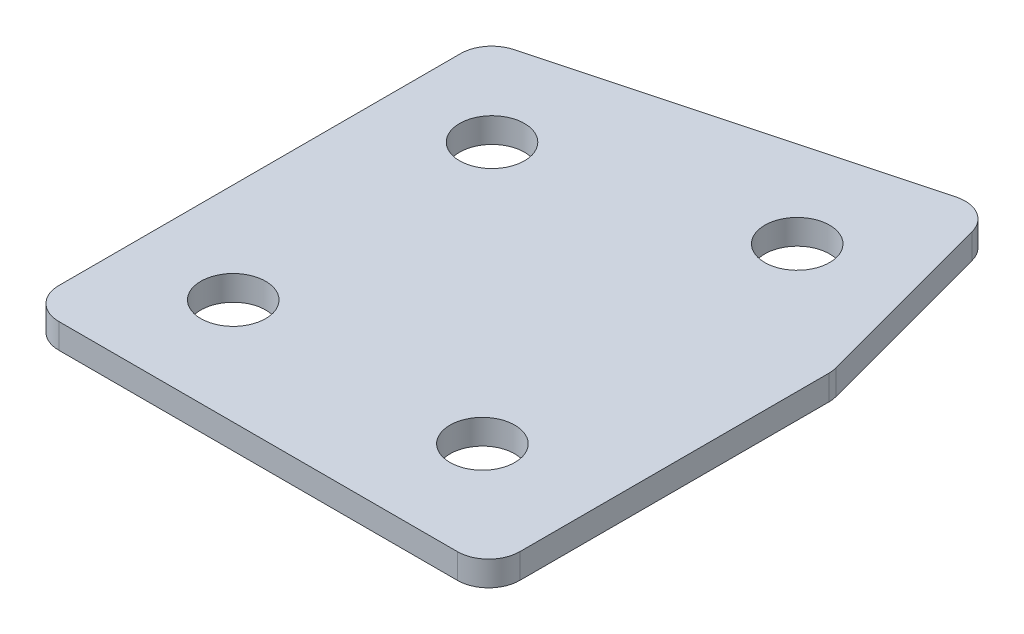
ISO-10303-21;
HEADER;
FILE_DESCRIPTION(('STEP AP214'),'2;1');
FILE_NAME('part.step','',(''),(''),'','','');
FILE_SCHEMA(('AUTOMOTIVE_DESIGN { 1 0 10303 214 1 1 1 1 }'));
ENDSEC;
DATA;
#1=APPLICATION_CONTEXT('core data for automotive mechanical design processes');
#2=APPLICATION_PROTOCOL_DEFINITION('international standard','automotive_design',2000,#1);
#3=PRODUCT_CONTEXT('',#1,'mechanical');
#4=PRODUCT('Part','Part','',(#3));
#5=PRODUCT_RELATED_PRODUCT_CATEGORY('part','',(#4));
#6=PRODUCT_DEFINITION_FORMATION('','',#4);
#7=PRODUCT_DEFINITION_CONTEXT('part definition',#1,'design');
#8=PRODUCT_DEFINITION('design','',#6,#7);
#9=PRODUCT_DEFINITION_SHAPE('','',#8);
#10=(LENGTH_UNIT() NAMED_UNIT(*) SI_UNIT(.MILLI.,.METRE.));
#11=(NAMED_UNIT(*) PLANE_ANGLE_UNIT() SI_UNIT($,.RADIAN.));
#12=(NAMED_UNIT(*) SI_UNIT($,.STERADIAN.) SOLID_ANGLE_UNIT());
#13=UNCERTAINTY_MEASURE_WITH_UNIT(LENGTH_MEASURE(1.E-05),#10,'distance_accuracy_value','');
#14=(GEOMETRIC_REPRESENTATION_CONTEXT(3) GLOBAL_UNCERTAINTY_ASSIGNED_CONTEXT((#13)) GLOBAL_UNIT_ASSIGNED_CONTEXT((#10,
#11,#12)) REPRESENTATION_CONTEXT('',''));
#15=CARTESIAN_POINT('',(0.,0.,0.));
#16=DIRECTION('',(0.,0.,1.));
#17=DIRECTION('',(1.,0.,0.));
#18=AXIS2_PLACEMENT_3D('',#15,#16,#17);
#19=CARTESIAN_POINT('',(-92.4222776450681,1.70798729371791,12.808819041555));
#20=DIRECTION('',(0.,1.,0.));
#21=DIRECTION('',(0.,0.,1.));
#22=AXIS2_PLACEMENT_3D('',#19,#20,#21);
#23=PLANE('',#22);
#24=CARTESIAN_POINT('',(7.85888258013483,1.70798729371791,12.808819041555));
#25=DIRECTION('',(0.,1.,0.));
#26=DIRECTION('',(0.,0.,1.));
#27=AXIS2_PLACEMENT_3D('',#24,#25,#26);
#28=CIRCLE('',#27,2.6);
#29=CARTESIAN_POINT('',(7.85888258013483,1.70798729371791,15.408819041555));
#30=VERTEX_POINT('',#29);
#31=EDGE_CURVE('E201',#30,#30,#28,.T.);
#32=ORIENTED_EDGE('',*,*,#31,.T.);
#33=EDGE_LOOP('',(#32));
#34=FACE_BOUND('',#33,.T.);
#35=CARTESIAN_POINT('',(6.59439677936349,1.70798729371791,-13.7226189076865));
#36=DIRECTION('',(0.,1.,0.));
#37=DIRECTION('',(0.,0.,1.));
#38=AXIS2_PLACEMENT_3D('',#35,#36,#37);
#39=CIRCLE('',#38,2.6);
#40=CARTESIAN_POINT('',(6.59439677936349,1.70798729371791,-11.1226189076865));
#41=VERTEX_POINT('',#40);
#42=EDGE_CURVE('E195',#41,#41,#39,.T.);
#43=ORIENTED_EDGE('',*,*,#42,.T.);
#44=EDGE_LOOP('',(#43));
#45=FACE_BOUND('',#44,.T.);
#46=CARTESIAN_POINT('',(-12.7241197464179,1.70798729371791,-8.5462380056361));
#47=DIRECTION('',(0.,1.,0.));
#48=DIRECTION('',(0.,0.,1.));
#49=AXIS2_PLACEMENT_3D('',#46,#47,#48);
#50=CIRCLE('',#49,2.6);
#51=CARTESIAN_POINT('',(-12.7241197464179,1.70798729371791,-5.94623800563609));
#52=VERTEX_POINT('',#51);
#53=EDGE_CURVE('E189',#52,#52,#50,.T.);
#54=ORIENTED_EDGE('',*,*,#53,.T.);
#55=EDGE_LOOP('',(#54));
#56=FACE_BOUND('',#55,.T.);
#57=CARTESIAN_POINT('',(-12.1411174198652,1.70798729371791,12.808819041555));
#58=DIRECTION('',(0.,1.,0.));
#59=DIRECTION('',(0.,0.,1.));
#60=AXIS2_PLACEMENT_3D('',#57,#58,#59);
#61=CIRCLE('',#60,2.6);
#62=CARTESIAN_POINT('',(-12.1411174198652,1.70798729371791,15.408819041555));
#63=VERTEX_POINT('',#62);
#64=EDGE_CURVE('E115',#63,#63,#61,.T.);
#65=ORIENTED_EDGE('',*,*,#64,.T.);
#66=EDGE_LOOP('',(#65));
#67=FACE_BOUND('',#66,.T.);
#68=DIRECTION('',(0.,0.,1.));
#69=VECTOR('',#68,1.);
#70=CARTESIAN_POINT('',(-20.1411174198652,1.70798729371791,-15.3587070022581));
#71=LINE('',#70,#69);
#72=CARTESIAN_POINT('',(-20.1411174198652,1.70798729371791,-13.4403895323107));
#73=VERTEX_POINT('',#72);
#74=CARTESIAN_POINT('',(-20.1411174198652,1.70798729371791,18.8088190415552));
#75=VERTEX_POINT('',#74);
#76=EDGE_CURVE('E182',#73,#75,#71,.T.);
#77=ORIENTED_EDGE('',*,*,#76,.F.);
#78=CARTESIAN_POINT('',(-17.6411174198652,1.70798729371791,-13.4403895323107));
#79=DIRECTION('',(0.,1.,0.));
#80=DIRECTION('',(0.,0.,1.));
#81=AXIS2_PLACEMENT_3D('',#78,#79,#80);
#82=CIRCLE('',#81,2.5);
#83=CARTESIAN_POINT('',(-18.2881650326215,1.70798729371791,-15.8552040980334));
#84=VERTEX_POINT('',#83);
#85=EDGE_CURVE('E146',#73,#84,#82,.F.);
#86=ORIENTED_EDGE('',*,*,#85,.T.);
#87=DIRECTION('',(-0.965925826289068,0.,0.258819045102521));
#88=VECTOR('',#87,1.);
#89=CARTESIAN_POINT('',(12.1218415063046,1.70798729371791,-24.0035407919638));
#90=LINE('',#89,#88);
#91=CARTESIAN_POINT('',(9.70702694058193,1.70798729371791,-23.3564931792075));
#92=VERTEX_POINT('',#91);
#93=EDGE_CURVE('E174',#92,#84,#90,.T.);
#94=ORIENTED_EDGE('',*,*,#93,.F.);
#95=CARTESIAN_POINT('',(10.3540745533382,1.70798729371791,-20.9416786134848));
#96=DIRECTION('',(0.,1.,0.));
#97=DIRECTION('',(0.,0.,1.));
#98=AXIS2_PLACEMENT_3D('',#95,#96,#97);
#99=CIRCLE('',#98,2.5);
#100=CARTESIAN_POINT('',(12.7688891190609,1.70798729371791,-21.5887262262411));
#101=VERTEX_POINT('',#100);
#102=EDGE_CURVE('E118',#92,#101,#99,.F.);
#103=ORIENTED_EDGE('',*,*,#102,.T.);
#104=DIRECTION('',(-0.25881904510252,0.,-0.965925826289069));
#105=VECTOR('',#104,1.);
#106=CARTESIAN_POINT('',(16.8588825801348,1.70798729371791,-6.32466282688861));
#107=LINE('',#106,#105);
#108=CARTESIAN_POINT('',(16.7736971458575,1.70798729371791,-6.64257919567641));
#109=VERTEX_POINT('',#108);
#110=EDGE_CURVE('E119',#109,#101,#107,.T.);
#111=ORIENTED_EDGE('',*,*,#110,.F.);
#112=CARTESIAN_POINT('',(14.3588825801348,1.70798729371791,-5.99553158292011));
#113=DIRECTION('',(0.,1.,0.));
#114=DIRECTION('',(0.,0.,1.));
#115=AXIS2_PLACEMENT_3D('',#112,#113,#114);
#116=CIRCLE('',#115,2.5);
#117=CARTESIAN_POINT('',(16.8588825801348,1.70798729371791,-5.99553158292011));
#118=VERTEX_POINT('',#117);
#119=EDGE_CURVE('E141',#109,#118,#116,.F.);
#120=ORIENTED_EDGE('',*,*,#119,.T.);
#121=DIRECTION('',(0.,0.,-1.));
#122=VECTOR('',#121,1.);
#123=CARTESIAN_POINT('',(16.8588825801348,1.70798729371791,21.3088190415552));
#124=LINE('',#123,#122);
#125=CARTESIAN_POINT('',(16.8588825801348,1.70798729371791,18.8088190415552));
#126=VERTEX_POINT('',#125);
#127=EDGE_CURVE('E123',#126,#118,#124,.T.);
#128=ORIENTED_EDGE('',*,*,#127,.F.);
#129=CARTESIAN_POINT('',(14.3588825801348,1.70798729371791,18.8088190415552));
#130=DIRECTION('',(0.,1.,0.));
#131=DIRECTION('',(0.,0.,1.));
#132=AXIS2_PLACEMENT_3D('',#129,#130,#131);
#133=CIRCLE('',#132,2.5);
#134=CARTESIAN_POINT('',(14.3588825801348,1.70798729371791,21.3088190415552));
#135=VERTEX_POINT('',#134);
#136=EDGE_CURVE('E31',#126,#135,#133,.F.);
#137=ORIENTED_EDGE('',*,*,#136,.T.);
#138=DIRECTION('',(1.,0.,0.));
#139=VECTOR('',#138,1.);
#140=CARTESIAN_POINT('',(-20.1411174198652,1.70798729371791,21.3088190415552));
#141=LINE('',#140,#139);
#142=CARTESIAN_POINT('',(-17.6411174198652,1.70798729371791,21.3088190415552));
#143=VERTEX_POINT('',#142);
#144=EDGE_CURVE('E180',#143,#135,#141,.T.);
#145=ORIENTED_EDGE('',*,*,#144,.F.);
#146=CARTESIAN_POINT('',(-17.6411174198652,1.70798729371791,18.8088190415552));
#147=DIRECTION('',(0.,1.,0.));
#148=DIRECTION('',(0.,0.,1.));
#149=AXIS2_PLACEMENT_3D('',#146,#147,#148);
#150=CIRCLE('',#149,2.5);
#151=EDGE_CURVE('E144',#143,#75,#150,.F.);
#152=ORIENTED_EDGE('',*,*,#151,.T.);
#153=EDGE_LOOP('',(#77,#86,#94,#103,#111,#120,#128,#137,#145,#152));
#154=FACE_BOUND('',#153,.T.);
#155=ADVANCED_FACE('F16',(#34,#45,#56,#67,#154),#23,.F.);
#156=CARTESIAN_POINT('',(12.1218415063046,1.70798729371791,-24.0035407919638));
#157=DIRECTION('',(-0.258819045102521,0.,-0.965925826289068));
#158=DIRECTION('',(-0.965925826289068,0.,0.258819045102521));
#159=AXIS2_PLACEMENT_3D('',#156,#157,#158);
#160=PLANE('',#159);
#161=ORIENTED_EDGE('',*,*,#93,.T.);
#162=DIRECTION('',(0.,1.,0.));
#163=VECTOR('',#162,1.);
#164=CARTESIAN_POINT('',(-18.2881650326215,1.70798729371791,-15.8552040980334));
#165=LINE('',#164,#163);
#166=CARTESIAN_POINT('',(-18.2881650326215,3.70798729371791,-15.8552040980334));
#167=VERTEX_POINT('',#166);
#168=EDGE_CURVE('E105',#84,#167,#165,.T.);
#169=ORIENTED_EDGE('',*,*,#168,.T.);
#170=DIRECTION('',(-0.965925826289068,0.,0.258819045102521));
#171=VECTOR('',#170,1.);
#172=CARTESIAN_POINT('',(12.1218415063046,3.70798729371791,-24.0035407919638));
#173=LINE('',#172,#171);
#174=CARTESIAN_POINT('',(9.70702694058193,3.70798729371791,-23.3564931792075));
#175=VERTEX_POINT('',#174);
#176=EDGE_CURVE('E97',#175,#167,#173,.T.);
#177=ORIENTED_EDGE('',*,*,#176,.F.);
#178=DIRECTION('',(0.,1.,0.));
#179=VECTOR('',#178,1.);
#180=CARTESIAN_POINT('',(9.70702694058193,1.70798729371791,-23.3564931792075));
#181=LINE('',#180,#179);
#182=EDGE_CURVE('E111',#175,#92,#181,.F.);
#183=ORIENTED_EDGE('',*,*,#182,.T.);
#184=EDGE_LOOP('',(#161,#169,#177,#183));
#185=FACE_BOUND('',#184,.T.);
#186=ADVANCED_FACE('F110',(#185),#160,.T.);
#187=CARTESIAN_POINT('',(16.8588825801348,1.70798729371791,-6.32466282688861));
#188=DIRECTION('',(0.965925826289069,0.,-0.25881904510252));
#189=DIRECTION('',(-0.25881904510252,0.,-0.965925826289069));
#190=AXIS2_PLACEMENT_3D('',#187,#188,#189);
#191=PLANE('',#190);
#192=DIRECTION('',(-0.25881904510252,0.,-0.965925826289069));
#193=VECTOR('',#192,1.);
#194=CARTESIAN_POINT('',(16.8588825801348,3.70798729371791,-6.32466282688861));
#195=LINE('',#194,#193);
#196=CARTESIAN_POINT('',(16.7736971458575,3.70798729371791,-6.64257919567641));
#197=VERTEX_POINT('',#196);
#198=CARTESIAN_POINT('',(12.7688891190609,3.70798729371791,-21.5887262262411));
#199=VERTEX_POINT('',#198);
#200=EDGE_CURVE('E99',#197,#199,#195,.T.);
#201=ORIENTED_EDGE('',*,*,#200,.F.);
#202=DIRECTION('',(0.,1.,0.));
#203=VECTOR('',#202,1.);
#204=CARTESIAN_POINT('',(16.7736971458575,1.70798729371791,-6.64257919567641));
#205=LINE('',#204,#203);
#206=EDGE_CURVE('E10',#197,#109,#205,.F.);
#207=ORIENTED_EDGE('',*,*,#206,.T.);
#208=ORIENTED_EDGE('',*,*,#110,.T.);
#209=DIRECTION('',(0.,1.,0.));
#210=VECTOR('',#209,1.);
#211=CARTESIAN_POINT('',(12.7688891190609,1.70798729371791,-21.5887262262411));
#212=LINE('',#211,#210);
#213=EDGE_CURVE('E24',#101,#199,#212,.T.);
#214=ORIENTED_EDGE('',*,*,#213,.T.);
#215=EDGE_LOOP('',(#201,#207,#208,#214));
#216=FACE_BOUND('',#215,.T.);
#217=ADVANCED_FACE('F157',(#216),#191,.T.);
#218=CARTESIAN_POINT('',(16.8588825801348,1.70798729371791,21.3088190415552));
#219=DIRECTION('',(1.,0.,0.));
#220=DIRECTION('',(0.,0.,-1.));
#221=AXIS2_PLACEMENT_3D('',#218,#219,#220);
#222=PLANE('',#221);
#223=DIRECTION('',(0.,0.,-1.));
#224=VECTOR('',#223,1.);
#225=CARTESIAN_POINT('',(16.8588825801348,3.70798729371791,21.3088190415552));
#226=LINE('',#225,#224);
#227=CARTESIAN_POINT('',(16.8588825801348,3.70798729371791,18.8088190415552));
#228=VERTEX_POINT('',#227);
#229=CARTESIAN_POINT('',(16.8588825801348,3.70798729371791,-5.99553158292011));
#230=VERTEX_POINT('',#229);
#231=EDGE_CURVE('E170',#228,#230,#226,.T.);
#232=ORIENTED_EDGE('',*,*,#231,.F.);
#233=DIRECTION('',(0.,1.,0.));
#234=VECTOR('',#233,1.);
#235=CARTESIAN_POINT('',(16.8588825801348,1.70798729371791,18.8088190415552));
#236=LINE('',#235,#234);
#237=EDGE_CURVE('E155',#228,#126,#236,.F.);
#238=ORIENTED_EDGE('',*,*,#237,.T.);
#239=ORIENTED_EDGE('',*,*,#127,.T.);
#240=DIRECTION('',(0.,1.,0.));
#241=VECTOR('',#240,1.);
#242=CARTESIAN_POINT('',(16.8588825801348,1.70798729371791,-5.99553158292011));
#243=LINE('',#242,#241);
#244=EDGE_CURVE('E152',#118,#230,#243,.T.);
#245=ORIENTED_EDGE('',*,*,#244,.T.);
#246=EDGE_LOOP('',(#232,#238,#239,#245));
#247=FACE_BOUND('',#246,.T.);
#248=ADVANCED_FACE('F169',(#247),#222,.T.);
#249=CARTESIAN_POINT('',(-20.1411174198652,1.70798729371791,21.3088190415552));
#250=DIRECTION('',(0.,0.,1.));
#251=DIRECTION('',(1.,0.,0.));
#252=AXIS2_PLACEMENT_3D('',#249,#250,#251);
#253=PLANE('',#252);
#254=DIRECTION('',(1.,0.,0.));
#255=VECTOR('',#254,1.);
#256=CARTESIAN_POINT('',(-20.1411174198652,3.70798729371791,21.3088190415552));
#257=LINE('',#256,#255);
#258=CARTESIAN_POINT('',(-17.6411174198652,3.70798729371791,21.3088190415552));
#259=VERTEX_POINT('',#258);
#260=CARTESIAN_POINT('',(14.3588825801348,3.70798729371791,21.3088190415552));
#261=VERTEX_POINT('',#260);
#262=EDGE_CURVE('E173',#259,#261,#257,.T.);
#263=ORIENTED_EDGE('',*,*,#262,.F.);
#264=DIRECTION('',(0.,1.,0.));
#265=VECTOR('',#264,1.);
#266=CARTESIAN_POINT('',(-17.6411174198652,1.70798729371791,21.3088190415552));
#267=LINE('',#266,#265);
#268=EDGE_CURVE('E38',#259,#143,#267,.F.);
#269=ORIENTED_EDGE('',*,*,#268,.T.);
#270=ORIENTED_EDGE('',*,*,#144,.T.);
#271=DIRECTION('',(0.,1.,0.));
#272=VECTOR('',#271,1.);
#273=CARTESIAN_POINT('',(14.3588825801348,1.70798729371791,21.3088190415552));
#274=LINE('',#273,#272);
#275=EDGE_CURVE('E148',#135,#261,#274,.T.);
#276=ORIENTED_EDGE('',*,*,#275,.T.);
#277=EDGE_LOOP('',(#263,#269,#270,#276));
#278=FACE_BOUND('',#277,.T.);
#279=ADVANCED_FACE('F333',(#278),#253,.T.);
#280=CARTESIAN_POINT('',(-20.1411174198652,1.70798729371791,-15.3587070022581));
#281=DIRECTION('',(-1.,0.,0.));
#282=DIRECTION('',(0.,0.,1.));
#283=AXIS2_PLACEMENT_3D('',#280,#281,#282);
#284=PLANE('',#283);
#285=DIRECTION('',(0.,0.,1.));
#286=VECTOR('',#285,1.);
#287=CARTESIAN_POINT('',(-20.1411174198652,3.70798729371791,-15.3587070022581));
#288=LINE('',#287,#286);
#289=CARTESIAN_POINT('',(-20.1411174198652,3.70798729371791,-13.4403895323107));
#290=VERTEX_POINT('',#289);
#291=CARTESIAN_POINT('',(-20.1411174198652,3.70798729371791,18.8088190415552));
#292=VERTEX_POINT('',#291);
#293=EDGE_CURVE('E114',#290,#292,#288,.T.);
#294=ORIENTED_EDGE('',*,*,#293,.F.);
#295=DIRECTION('',(0.,1.,0.));
#296=VECTOR('',#295,1.);
#297=CARTESIAN_POINT('',(-20.1411174198652,1.70798729371791,-13.4403895323107));
#298=LINE('',#297,#296);
#299=EDGE_CURVE('E138',#290,#73,#298,.F.);
#300=ORIENTED_EDGE('',*,*,#299,.T.);
#301=ORIENTED_EDGE('',*,*,#76,.T.);
#302=DIRECTION('',(0.,1.,0.));
#303=VECTOR('',#302,1.);
#304=CARTESIAN_POINT('',(-20.1411174198652,1.70798729371791,18.8088190415552));
#305=LINE('',#304,#303);
#306=EDGE_CURVE('E135',#75,#292,#305,.T.);
#307=ORIENTED_EDGE('',*,*,#306,.T.);
#308=EDGE_LOOP('',(#294,#300,#301,#307));
#309=FACE_BOUND('',#308,.T.);
#310=ADVANCED_FACE('F223',(#309),#284,.T.);
#311=CARTESIAN_POINT('',(-92.4222776450681,3.70798729371791,12.808819041555));
#312=DIRECTION('',(0.,1.,0.));
#313=DIRECTION('',(0.,0.,1.));
#314=AXIS2_PLACEMENT_3D('',#311,#312,#313);
#315=PLANE('',#314);
#316=CARTESIAN_POINT('',(7.85888258013483,3.70798729371791,12.808819041555));
#317=DIRECTION('',(0.,1.,0.));
#318=DIRECTION('',(0.,0.,1.));
#319=AXIS2_PLACEMENT_3D('',#316,#317,#318);
#320=CIRCLE('',#319,2.6);
#321=CARTESIAN_POINT('',(7.85888258013483,3.70798729371791,15.408819041555));
#322=VERTEX_POINT('',#321);
#323=EDGE_CURVE('E204',#322,#322,#320,.T.);
#324=ORIENTED_EDGE('',*,*,#323,.F.);
#325=EDGE_LOOP('',(#324));
#326=FACE_BOUND('',#325,.T.);
#327=CARTESIAN_POINT('',(6.59439677936349,3.70798729371791,-13.7226189076865));
#328=DIRECTION('',(0.,1.,0.));
#329=DIRECTION('',(0.,0.,1.));
#330=AXIS2_PLACEMENT_3D('',#327,#328,#329);
#331=CIRCLE('',#330,2.6);
#332=CARTESIAN_POINT('',(6.59439677936349,3.70798729371791,-11.1226189076865));
#333=VERTEX_POINT('',#332);
#334=EDGE_CURVE('E198',#333,#333,#331,.T.);
#335=ORIENTED_EDGE('',*,*,#334,.F.);
#336=EDGE_LOOP('',(#335));
#337=FACE_BOUND('',#336,.T.);
#338=CARTESIAN_POINT('',(-12.7241197464179,3.70798729371791,-8.5462380056361));
#339=DIRECTION('',(0.,1.,0.));
#340=DIRECTION('',(0.,0.,1.));
#341=AXIS2_PLACEMENT_3D('',#338,#339,#340);
#342=CIRCLE('',#341,2.6);
#343=CARTESIAN_POINT('',(-12.7241197464179,3.70798729371791,-5.94623800563609));
#344=VERTEX_POINT('',#343);
#345=EDGE_CURVE('E192',#344,#344,#342,.T.);
#346=ORIENTED_EDGE('',*,*,#345,.F.);
#347=EDGE_LOOP('',(#346));
#348=FACE_BOUND('',#347,.T.);
#349=CARTESIAN_POINT('',(-12.1411174198652,3.70798729371791,12.808819041555));
#350=DIRECTION('',(0.,1.,0.));
#351=DIRECTION('',(0.,0.,1.));
#352=AXIS2_PLACEMENT_3D('',#349,#350,#351);
#353=CIRCLE('',#352,2.6);
#354=CARTESIAN_POINT('',(-12.1411174198652,3.70798729371791,15.408819041555));
#355=VERTEX_POINT('',#354);
#356=EDGE_CURVE('E186',#355,#355,#353,.T.);
#357=ORIENTED_EDGE('',*,*,#356,.F.);
#358=EDGE_LOOP('',(#357));
#359=FACE_BOUND('',#358,.T.);
#360=ORIENTED_EDGE('',*,*,#176,.T.);
#361=CARTESIAN_POINT('',(-17.6411174198652,3.70798729371791,-13.4403895323107));
#362=DIRECTION('',(0.,1.,0.));
#363=DIRECTION('',(0.,0.,1.));
#364=AXIS2_PLACEMENT_3D('',#361,#362,#363);
#365=CIRCLE('',#364,2.5);
#366=EDGE_CURVE('E133',#167,#290,#365,.T.);
#367=ORIENTED_EDGE('',*,*,#366,.T.);
#368=ORIENTED_EDGE('',*,*,#293,.T.);
#369=CARTESIAN_POINT('',(-17.6411174198652,3.70798729371791,18.8088190415552));
#370=DIRECTION('',(0.,1.,0.));
#371=DIRECTION('',(0.,0.,1.));
#372=AXIS2_PLACEMENT_3D('',#369,#370,#371);
#373=CIRCLE('',#372,2.5);
#374=EDGE_CURVE('E131',#292,#259,#373,.T.);
#375=ORIENTED_EDGE('',*,*,#374,.T.);
#376=ORIENTED_EDGE('',*,*,#262,.T.);
#377=CARTESIAN_POINT('',(14.3588825801348,3.70798729371791,18.8088190415552));
#378=DIRECTION('',(0.,1.,0.));
#379=DIRECTION('',(0.,0.,1.));
#380=AXIS2_PLACEMENT_3D('',#377,#378,#379);
#381=CIRCLE('',#380,2.5);
#382=EDGE_CURVE('E129',#261,#228,#381,.T.);
#383=ORIENTED_EDGE('',*,*,#382,.T.);
#384=ORIENTED_EDGE('',*,*,#231,.T.);
#385=CARTESIAN_POINT('',(14.3588825801348,3.70798729371791,-5.99553158292011));
#386=DIRECTION('',(0.,1.,0.));
#387=DIRECTION('',(0.,0.,1.));
#388=AXIS2_PLACEMENT_3D('',#385,#386,#387);
#389=CIRCLE('',#388,2.5);
#390=EDGE_CURVE('E104',#230,#197,#389,.T.);
#391=ORIENTED_EDGE('',*,*,#390,.T.);
#392=ORIENTED_EDGE('',*,*,#200,.T.);
#393=CARTESIAN_POINT('',(10.3540745533382,3.70798729371791,-20.9416786134848));
#394=DIRECTION('',(0.,1.,0.));
#395=DIRECTION('',(0.,0.,1.));
#396=AXIS2_PLACEMENT_3D('',#393,#394,#395);
#397=CIRCLE('',#396,2.5);
#398=EDGE_CURVE('E94',#199,#175,#397,.T.);
#399=ORIENTED_EDGE('',*,*,#398,.T.);
#400=EDGE_LOOP('',(#360,#367,#368,#375,#376,#383,#384,#391,#392,#399));
#401=FACE_BOUND('',#400,.T.);
#402=ADVANCED_FACE('F96',(#326,#337,#348,#359,#401),#315,.T.);
#403=CARTESIAN_POINT('',(-12.1411174198652,1.70798729371791,12.808819041555));
#404=DIRECTION('',(0.,1.,0.));
#405=DIRECTION('',(0.,0.,1.));
#406=AXIS2_PLACEMENT_3D('',#403,#404,#405);
#407=CYLINDRICAL_SURFACE('',#406,2.6);
#408=ORIENTED_EDGE('',*,*,#64,.F.);
#409=EDGE_LOOP('',(#408));
#410=FACE_BOUND('',#409,.T.);
#411=ORIENTED_EDGE('',*,*,#356,.T.);
#412=EDGE_LOOP('',(#411));
#413=FACE_BOUND('',#412,.T.);
#414=ADVANCED_FACE('F222',(#410,#413),#407,.F.);
#415=CARTESIAN_POINT('',(-12.7241197464179,1.70798729371791,-8.5462380056361));
#416=DIRECTION('',(0.,1.,0.));
#417=DIRECTION('',(0.,0.,1.));
#418=AXIS2_PLACEMENT_3D('',#415,#416,#417);
#419=CYLINDRICAL_SURFACE('',#418,2.6);
#420=ORIENTED_EDGE('',*,*,#53,.F.);
#421=EDGE_LOOP('',(#420));
#422=FACE_BOUND('',#421,.T.);
#423=ORIENTED_EDGE('',*,*,#345,.T.);
#424=EDGE_LOOP('',(#423));
#425=FACE_BOUND('',#424,.T.);
#426=ADVANCED_FACE('F232',(#422,#425),#419,.F.);
#427=CARTESIAN_POINT('',(6.59439677936349,1.70798729371791,-13.7226189076865));
#428=DIRECTION('',(0.,1.,0.));
#429=DIRECTION('',(0.,0.,1.));
#430=AXIS2_PLACEMENT_3D('',#427,#428,#429);
#431=CYLINDRICAL_SURFACE('',#430,2.6);
#432=ORIENTED_EDGE('',*,*,#42,.F.);
#433=EDGE_LOOP('',(#432));
#434=FACE_BOUND('',#433,.T.);
#435=ORIENTED_EDGE('',*,*,#334,.T.);
#436=EDGE_LOOP('',(#435));
#437=FACE_BOUND('',#436,.T.);
#438=ADVANCED_FACE('F216',(#434,#437),#431,.F.);
#439=CARTESIAN_POINT('',(7.85888258013483,1.70798729371791,12.808819041555));
#440=DIRECTION('',(0.,1.,0.));
#441=DIRECTION('',(0.,0.,1.));
#442=AXIS2_PLACEMENT_3D('',#439,#440,#441);
#443=CYLINDRICAL_SURFACE('',#442,2.6);
#444=ORIENTED_EDGE('',*,*,#31,.F.);
#445=EDGE_LOOP('',(#444));
#446=FACE_BOUND('',#445,.T.);
#447=ORIENTED_EDGE('',*,*,#323,.T.);
#448=EDGE_LOOP('',(#447));
#449=FACE_BOUND('',#448,.T.);
#450=ADVANCED_FACE('F212',(#446,#449),#443,.F.);
#451=CARTESIAN_POINT('',(-17.6411174198652,1.70798729371791,-13.4403895323107));
#452=DIRECTION('',(0.,1.,0.));
#453=DIRECTION('',(0.,0.,1.));
#454=AXIS2_PLACEMENT_3D('',#451,#452,#453);
#455=CYLINDRICAL_SURFACE('',#454,2.5);
#456=ORIENTED_EDGE('',*,*,#85,.F.);
#457=ORIENTED_EDGE('',*,*,#299,.F.);
#458=ORIENTED_EDGE('',*,*,#366,.F.);
#459=ORIENTED_EDGE('',*,*,#168,.F.);
#460=EDGE_LOOP('',(#456,#457,#458,#459));
#461=FACE_BOUND('',#460,.T.);
#462=ADVANCED_FACE('F215',(#461),#455,.T.);
#463=CARTESIAN_POINT('',(-17.6411174198652,1.70798729371791,18.8088190415552));
#464=DIRECTION('',(0.,1.,0.));
#465=DIRECTION('',(0.,0.,1.));
#466=AXIS2_PLACEMENT_3D('',#463,#464,#465);
#467=CYLINDRICAL_SURFACE('',#466,2.5);
#468=ORIENTED_EDGE('',*,*,#151,.F.);
#469=ORIENTED_EDGE('',*,*,#268,.F.);
#470=ORIENTED_EDGE('',*,*,#374,.F.);
#471=ORIENTED_EDGE('',*,*,#306,.F.);
#472=EDGE_LOOP('',(#468,#469,#470,#471));
#473=FACE_BOUND('',#472,.T.);
#474=ADVANCED_FACE('F252',(#473),#467,.T.);
#475=CARTESIAN_POINT('',(14.3588825801348,1.70798729371791,18.8088190415552));
#476=DIRECTION('',(0.,1.,0.));
#477=DIRECTION('',(0.,0.,1.));
#478=AXIS2_PLACEMENT_3D('',#475,#476,#477);
#479=CYLINDRICAL_SURFACE('',#478,2.5);
#480=ORIENTED_EDGE('',*,*,#136,.F.);
#481=ORIENTED_EDGE('',*,*,#237,.F.);
#482=ORIENTED_EDGE('',*,*,#382,.F.);
#483=ORIENTED_EDGE('',*,*,#275,.F.);
#484=EDGE_LOOP('',(#480,#481,#482,#483));
#485=FACE_BOUND('',#484,.T.);
#486=ADVANCED_FACE('F256',(#485),#479,.T.);
#487=CARTESIAN_POINT('',(14.3588825801348,1.70798729371791,-5.99553158292011));
#488=DIRECTION('',(0.,1.,0.));
#489=DIRECTION('',(0.,0.,1.));
#490=AXIS2_PLACEMENT_3D('',#487,#488,#489);
#491=CYLINDRICAL_SURFACE('',#490,2.5);
#492=ORIENTED_EDGE('',*,*,#119,.F.);
#493=ORIENTED_EDGE('',*,*,#206,.F.);
#494=ORIENTED_EDGE('',*,*,#390,.F.);
#495=ORIENTED_EDGE('',*,*,#244,.F.);
#496=EDGE_LOOP('',(#492,#493,#494,#495));
#497=FACE_BOUND('',#496,.T.);
#498=ADVANCED_FACE('F165',(#497),#491,.T.);
#499=CARTESIAN_POINT('',(10.3540745533382,1.70798729371791,-20.9416786134848));
#500=DIRECTION('',(0.,1.,0.));
#501=DIRECTION('',(0.,0.,1.));
#502=AXIS2_PLACEMENT_3D('',#499,#500,#501);
#503=CYLINDRICAL_SURFACE('',#502,2.5);
#504=ORIENTED_EDGE('',*,*,#102,.F.);
#505=ORIENTED_EDGE('',*,*,#182,.F.);
#506=ORIENTED_EDGE('',*,*,#398,.F.);
#507=ORIENTED_EDGE('',*,*,#213,.F.);
#508=EDGE_LOOP('',(#504,#505,#506,#507));
#509=FACE_BOUND('',#508,.T.);
#510=ADVANCED_FACE('F18',(#509),#503,.T.);
#511=CLOSED_SHELL('',(#155,#186,#217,#248,#279,#310,#402,#414,#426,#438,#450,#462,#474,#486,
#498,#510));
#512=MANIFOLD_SOLID_BREP('B1',#511);
#513=ADVANCED_BREP_SHAPE_REPRESENTATION('',(#18,#512),#14);
#514=SHAPE_DEFINITION_REPRESENTATION(#9,#513);
ENDSEC;
END-ISO-10303-21;
